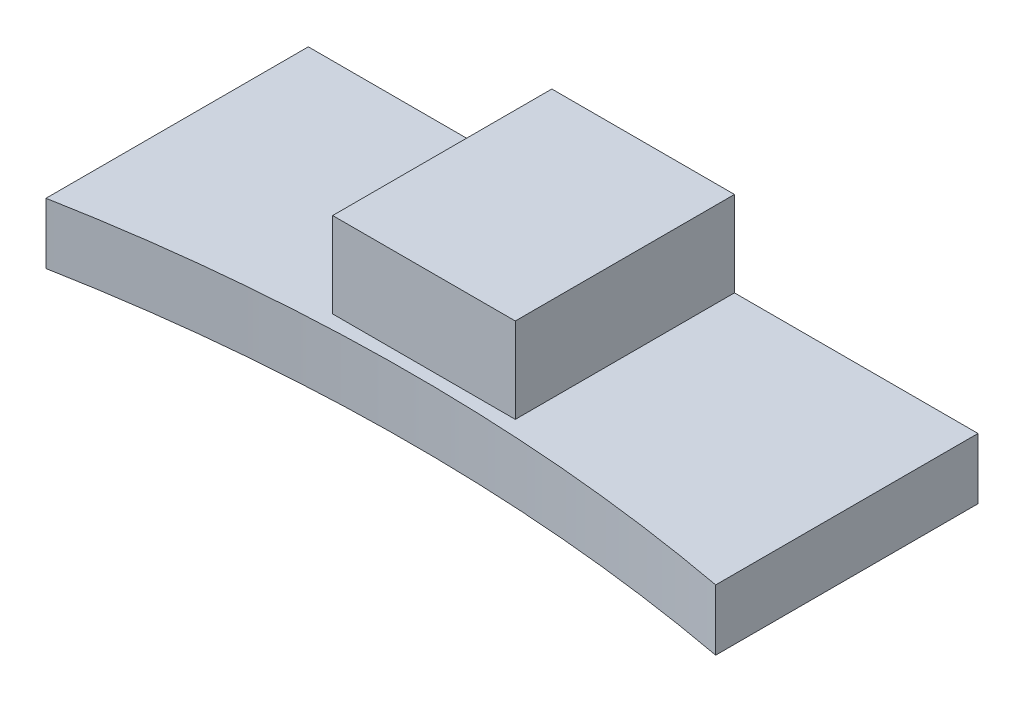
ISO-10303-21;
HEADER;
FILE_DESCRIPTION(('STEP AP214'),'2;1');
FILE_NAME('part.step','',(''),(''),'','','');
FILE_SCHEMA(('AUTOMOTIVE_DESIGN { 1 0 10303 214 1 1 1 1 }'));
ENDSEC;
DATA;
#1=APPLICATION_CONTEXT('core data for automotive mechanical design processes');
#2=APPLICATION_PROTOCOL_DEFINITION('international standard','automotive_design',2000,#1);
#3=PRODUCT_CONTEXT('',#1,'mechanical');
#4=PRODUCT('Part','Part','',(#3));
#5=PRODUCT_RELATED_PRODUCT_CATEGORY('part','',(#4));
#6=PRODUCT_DEFINITION_FORMATION('','',#4);
#7=PRODUCT_DEFINITION_CONTEXT('part definition',#1,'design');
#8=PRODUCT_DEFINITION('design','',#6,#7);
#9=PRODUCT_DEFINITION_SHAPE('','',#8);
#10=(LENGTH_UNIT() NAMED_UNIT(*) SI_UNIT(.MILLI.,.METRE.));
#11=(NAMED_UNIT(*) PLANE_ANGLE_UNIT() SI_UNIT($,.RADIAN.));
#12=(NAMED_UNIT(*) SI_UNIT($,.STERADIAN.) SOLID_ANGLE_UNIT());
#13=UNCERTAINTY_MEASURE_WITH_UNIT(LENGTH_MEASURE(1.E-05),#10,'distance_accuracy_value','');
#14=(GEOMETRIC_REPRESENTATION_CONTEXT(3) GLOBAL_UNCERTAINTY_ASSIGNED_CONTEXT((#13)) GLOBAL_UNIT_ASSIGNED_CONTEXT((#10,
#11,#12)) REPRESENTATION_CONTEXT('',''));
#15=CARTESIAN_POINT('',(0.,0.,0.));
#16=DIRECTION('',(0.,0.,1.));
#17=DIRECTION('',(1.,0.,0.));
#18=AXIS2_PLACEMENT_3D('',#15,#16,#17);
#19=CARTESIAN_POINT('',(27.5,5.,147.457621030586));
#20=DIRECTION('',(0.,-1.,0.));
#21=DIRECTION('',(0.,0.,-1.));
#22=AXIS2_PLACEMENT_3D('',#19,#20,#21);
#23=PLANE('',#22);
#24=DIRECTION('',(0.,0.,1.));
#25=VECTOR('',#24,1.);
#26=CARTESIAN_POINT('',(20.,5.,-21.5423789694138));
#27=LINE('',#26,#25);
#28=CARTESIAN_POINT('',(20.,5.,-21.5423789694138));
#29=VERTEX_POINT('',#28);
#30=CARTESIAN_POINT('',(20.,5.,-3.54237896941376));
#31=VERTEX_POINT('',#30);
#32=EDGE_CURVE('E55',#29,#31,#27,.T.);
#33=ORIENTED_EDGE('',*,*,#32,.F.);
#34=DIRECTION('',(-1.,0.,0.));
#35=VECTOR('',#34,1.);
#36=CARTESIAN_POINT('',(0.,5.,-21.5423789694138));
#37=LINE('',#36,#35);
#38=CARTESIAN_POINT('',(0.,5.,-21.5423789694138));
#39=VERTEX_POINT('',#38);
#40=EDGE_CURVE('E135',#29,#39,#37,.T.);
#41=ORIENTED_EDGE('',*,*,#40,.T.);
#42=DIRECTION('',(0.,0.,1.));
#43=VECTOR('',#42,1.);
#44=CARTESIAN_POINT('',(0.,5.,0.));
#45=LINE('',#44,#43);
#46=CARTESIAN_POINT('',(0.,5.,0.));
#47=VERTEX_POINT('',#46);
#48=EDGE_CURVE('E138',#39,#47,#45,.T.);
#49=ORIENTED_EDGE('',*,*,#48,.T.);
#50=CARTESIAN_POINT('',(27.5,5.,147.457621030586));
#51=DIRECTION('',(0.,-1.,0.));
#52=DIRECTION('',(0.,0.,-1.));
#53=AXIS2_PLACEMENT_3D('',#50,#51,#52);
#54=CIRCLE('',#53,150.);
#55=CARTESIAN_POINT('',(55.,5.,0.));
#56=VERTEX_POINT('',#55);
#57=EDGE_CURVE('E129',#47,#56,#54,.T.);
#58=ORIENTED_EDGE('',*,*,#57,.T.);
#59=DIRECTION('',(0.,0.,-1.));
#60=VECTOR('',#59,1.);
#61=CARTESIAN_POINT('',(55.,5.,-21.5423789694138));
#62=LINE('',#61,#60);
#63=CARTESIAN_POINT('',(55.,5.,-21.5423789694138));
#64=VERTEX_POINT('',#63);
#65=EDGE_CURVE('E132',#56,#64,#62,.T.);
#66=ORIENTED_EDGE('',*,*,#65,.T.);
#67=CARTESIAN_POINT('',(35.,5.,-21.5423789694138));
#68=VERTEX_POINT('',#67);
#69=EDGE_CURVE('E143',#64,#68,#37,.T.);
#70=ORIENTED_EDGE('',*,*,#69,.T.);
#71=DIRECTION('',(0.,0.,-1.));
#72=VECTOR('',#71,1.);
#73=CARTESIAN_POINT('',(35.,5.,-21.5423789694138));
#74=LINE('',#73,#72);
#75=CARTESIAN_POINT('',(35.,5.,-3.54237896941376));
#76=VERTEX_POINT('',#75);
#77=EDGE_CURVE('E117',#76,#68,#74,.T.);
#78=ORIENTED_EDGE('',*,*,#77,.F.);
#79=DIRECTION('',(1.,0.,0.));
#80=VECTOR('',#79,1.);
#81=CARTESIAN_POINT('',(20.,5.,-3.54237896941376));
#82=LINE('',#81,#80);
#83=EDGE_CURVE('E50',#31,#76,#82,.T.);
#84=ORIENTED_EDGE('',*,*,#83,.F.);
#85=EDGE_LOOP('',(#33,#41,#49,#58,#66,#70,#78,#84));
#86=FACE_BOUND('',#85,.T.);
#87=ADVANCED_FACE('F33',(#86),#23,.F.);
#88=CARTESIAN_POINT('',(27.5,5.,147.457621030586));
#89=DIRECTION('',(0.,-1.,0.));
#90=DIRECTION('',(0.,0.,-1.));
#91=AXIS2_PLACEMENT_3D('',#88,#89,#90);
#92=CYLINDRICAL_SURFACE('',#91,150.);
#93=CARTESIAN_POINT('',(27.5,0.,147.457621030586));
#94=DIRECTION('',(0.,-1.,0.));
#95=DIRECTION('',(0.,0.,-1.));
#96=AXIS2_PLACEMENT_3D('',#93,#94,#95);
#97=CIRCLE('',#96,150.);
#98=CARTESIAN_POINT('',(0.,0.,0.));
#99=VERTEX_POINT('',#98);
#100=CARTESIAN_POINT('',(55.,0.,0.));
#101=VERTEX_POINT('',#100);
#102=EDGE_CURVE('E120',#99,#101,#97,.T.);
#103=ORIENTED_EDGE('',*,*,#102,.T.);
#104=DIRECTION('',(0.,-1.,0.));
#105=VECTOR('',#104,1.);
#106=CARTESIAN_POINT('',(55.,5.,0.));
#107=LINE('',#106,#105);
#108=EDGE_CURVE('E11',#56,#101,#107,.T.);
#109=ORIENTED_EDGE('',*,*,#108,.F.);
#110=ORIENTED_EDGE('',*,*,#57,.F.);
#111=DIRECTION('',(0.,-1.,0.));
#112=VECTOR('',#111,1.);
#113=CARTESIAN_POINT('',(0.,5.,0.));
#114=LINE('',#113,#112);
#115=EDGE_CURVE('E150',#47,#99,#114,.T.);
#116=ORIENTED_EDGE('',*,*,#115,.T.);
#117=EDGE_LOOP('',(#103,#109,#110,#116));
#118=FACE_BOUND('',#117,.T.);
#119=ADVANCED_FACE('F35',(#118),#92,.F.);
#120=CARTESIAN_POINT('',(55.,5.,-21.5423789694138));
#121=DIRECTION('',(-1.,0.,0.));
#122=DIRECTION('',(0.,0.,1.));
#123=AXIS2_PLACEMENT_3D('',#120,#121,#122);
#124=PLANE('',#123);
#125=DIRECTION('',(0.,0.,-1.));
#126=VECTOR('',#125,1.);
#127=CARTESIAN_POINT('',(55.,0.,-21.5423789694138));
#128=LINE('',#127,#126);
#129=CARTESIAN_POINT('',(55.,0.,-21.5423789694138));
#130=VERTEX_POINT('',#129);
#131=EDGE_CURVE('E123',#101,#130,#128,.T.);
#132=ORIENTED_EDGE('',*,*,#131,.T.);
#133=DIRECTION('',(0.,-1.,0.));
#134=VECTOR('',#133,1.);
#135=CARTESIAN_POINT('',(55.,5.,-21.5423789694138));
#136=LINE('',#135,#134);
#137=EDGE_CURVE('E42',#64,#130,#136,.T.);
#138=ORIENTED_EDGE('',*,*,#137,.F.);
#139=ORIENTED_EDGE('',*,*,#65,.F.);
#140=ORIENTED_EDGE('',*,*,#108,.T.);
#141=EDGE_LOOP('',(#132,#138,#139,#140));
#142=FACE_BOUND('',#141,.T.);
#143=ADVANCED_FACE('F158',(#142),#124,.F.);
#144=CARTESIAN_POINT('',(0.,5.,-21.5423789694138));
#145=DIRECTION('',(0.,0.,1.));
#146=DIRECTION('',(1.,0.,0.));
#147=AXIS2_PLACEMENT_3D('',#144,#145,#146);
#148=PLANE('',#147);
#149=CARTESIAN_POINT('',(27.5,6.5,-21.5423789694138));
#150=DIRECTION('',(0.,0.,-1.));
#151=DIRECTION('',(-1.,0.,0.));
#152=AXIS2_PLACEMENT_3D('',#149,#150,#151);
#153=CIRCLE('',#152,4.5);
#154=CARTESIAN_POINT('',(23.,6.5,-21.5423789694138));
#155=VERTEX_POINT('',#154);
#156=EDGE_CURVE('E189',#155,#155,#153,.T.);
#157=ORIENTED_EDGE('',*,*,#156,.F.);
#158=EDGE_LOOP('',(#157));
#159=FACE_BOUND('',#158,.T.);
#160=DIRECTION('',(-1.,0.,0.));
#161=VECTOR('',#160,1.);
#162=CARTESIAN_POINT('',(0.,0.,-21.5423789694138));
#163=LINE('',#162,#161);
#164=CARTESIAN_POINT('',(0.,0.,-21.5423789694138));
#165=VERTEX_POINT('',#164);
#166=EDGE_CURVE('E154',#130,#165,#163,.T.);
#167=ORIENTED_EDGE('',*,*,#166,.T.);
#168=DIRECTION('',(0.,-1.,0.));
#169=VECTOR('',#168,1.);
#170=CARTESIAN_POINT('',(0.,5.,-21.5423789694138));
#171=LINE('',#170,#169);
#172=EDGE_CURVE('E147',#39,#165,#171,.T.);
#173=ORIENTED_EDGE('',*,*,#172,.F.);
#174=ORIENTED_EDGE('',*,*,#40,.F.);
#175=DIRECTION('',(0.,-1.,0.));
#176=VECTOR('',#175,1.);
#177=CARTESIAN_POINT('',(20.,12.,-21.5423789694138));
#178=LINE('',#177,#176);
#179=CARTESIAN_POINT('',(20.,12.,-21.5423789694138));
#180=VERTEX_POINT('',#179);
#181=EDGE_CURVE('E176',#180,#29,#178,.T.);
#182=ORIENTED_EDGE('',*,*,#181,.F.);
#183=DIRECTION('',(-1.,0.,0.));
#184=VECTOR('',#183,1.);
#185=CARTESIAN_POINT('',(20.,12.,-21.5423789694138));
#186=LINE('',#185,#184);
#187=CARTESIAN_POINT('',(35.,12.,-21.5423789694138));
#188=VERTEX_POINT('',#187);
#189=EDGE_CURVE('E113',#188,#180,#186,.T.);
#190=ORIENTED_EDGE('',*,*,#189,.F.);
#191=DIRECTION('',(0.,-1.,0.));
#192=VECTOR('',#191,1.);
#193=CARTESIAN_POINT('',(35.,12.,-21.5423789694138));
#194=LINE('',#193,#192);
#195=EDGE_CURVE('E125',#188,#68,#194,.T.);
#196=ORIENTED_EDGE('',*,*,#195,.T.);
#197=ORIENTED_EDGE('',*,*,#69,.F.);
#198=ORIENTED_EDGE('',*,*,#137,.T.);
#199=EDGE_LOOP('',(#167,#173,#174,#182,#190,#196,#197,#198));
#200=FACE_BOUND('',#199,.T.);
#201=ADVANCED_FACE('F165',(#159,#200),#148,.F.);
#202=CARTESIAN_POINT('',(0.,5.,0.));
#203=DIRECTION('',(1.,0.,0.));
#204=DIRECTION('',(0.,0.,-1.));
#205=AXIS2_PLACEMENT_3D('',#202,#203,#204);
#206=PLANE('',#205);
#207=DIRECTION('',(0.,0.,1.));
#208=VECTOR('',#207,1.);
#209=CARTESIAN_POINT('',(0.,0.,0.));
#210=LINE('',#209,#208);
#211=EDGE_CURVE('E133',#165,#99,#210,.T.);
#212=ORIENTED_EDGE('',*,*,#211,.T.);
#213=ORIENTED_EDGE('',*,*,#115,.F.);
#214=ORIENTED_EDGE('',*,*,#48,.F.);
#215=ORIENTED_EDGE('',*,*,#172,.T.);
#216=EDGE_LOOP('',(#212,#213,#214,#215));
#217=FACE_BOUND('',#216,.T.);
#218=ADVANCED_FACE('F172',(#217),#206,.F.);
#219=CARTESIAN_POINT('',(27.5,0.,147.457621030586));
#220=DIRECTION('',(0.,-1.,0.));
#221=DIRECTION('',(0.,0.,-1.));
#222=AXIS2_PLACEMENT_3D('',#219,#220,#221);
#223=PLANE('',#222);
#224=ORIENTED_EDGE('',*,*,#102,.F.);
#225=ORIENTED_EDGE('',*,*,#211,.F.);
#226=ORIENTED_EDGE('',*,*,#166,.F.);
#227=ORIENTED_EDGE('',*,*,#131,.F.);
#228=EDGE_LOOP('',(#224,#225,#226,#227));
#229=FACE_BOUND('',#228,.T.);
#230=ADVANCED_FACE('F169',(#229),#223,.T.);
#231=CARTESIAN_POINT('',(20.,12.,-21.5423789694138));
#232=DIRECTION('',(1.,0.,0.));
#233=DIRECTION('',(0.,0.,-1.));
#234=AXIS2_PLACEMENT_3D('',#231,#232,#233);
#235=PLANE('',#234);
#236=ORIENTED_EDGE('',*,*,#32,.T.);
#237=DIRECTION('',(0.,-1.,0.));
#238=VECTOR('',#237,1.);
#239=CARTESIAN_POINT('',(20.,12.,-3.54237896941376));
#240=LINE('',#239,#238);
#241=CARTESIAN_POINT('',(20.,12.,-3.54237896941376));
#242=VERTEX_POINT('',#241);
#243=EDGE_CURVE('E102',#242,#31,#240,.T.);
#244=ORIENTED_EDGE('',*,*,#243,.F.);
#245=DIRECTION('',(0.,0.,1.));
#246=VECTOR('',#245,1.);
#247=CARTESIAN_POINT('',(20.,12.,-21.5423789694138));
#248=LINE('',#247,#246);
#249=EDGE_CURVE('E108',#180,#242,#248,.T.);
#250=ORIENTED_EDGE('',*,*,#249,.F.);
#251=ORIENTED_EDGE('',*,*,#181,.T.);
#252=EDGE_LOOP('',(#236,#244,#250,#251));
#253=FACE_BOUND('',#252,.T.);
#254=ADVANCED_FACE('F119',(#253),#235,.F.);
#255=CARTESIAN_POINT('',(20.,12.,-3.54237896941376));
#256=DIRECTION('',(0.,0.,-1.));
#257=DIRECTION('',(-1.,0.,0.));
#258=AXIS2_PLACEMENT_3D('',#255,#256,#257);
#259=PLANE('',#258);
#260=ORIENTED_EDGE('',*,*,#83,.T.);
#261=DIRECTION('',(0.,-1.,0.));
#262=VECTOR('',#261,1.);
#263=CARTESIAN_POINT('',(35.,12.,-3.54237896941376));
#264=LINE('',#263,#262);
#265=CARTESIAN_POINT('',(35.,12.,-3.54237896941376));
#266=VERTEX_POINT('',#265);
#267=EDGE_CURVE('E104',#266,#76,#264,.T.);
#268=ORIENTED_EDGE('',*,*,#267,.F.);
#269=DIRECTION('',(1.,0.,0.));
#270=VECTOR('',#269,1.);
#271=CARTESIAN_POINT('',(20.,12.,-3.54237896941376));
#272=LINE('',#271,#270);
#273=EDGE_CURVE('E98',#242,#266,#272,.T.);
#274=ORIENTED_EDGE('',*,*,#273,.F.);
#275=ORIENTED_EDGE('',*,*,#243,.T.);
#276=EDGE_LOOP('',(#260,#268,#274,#275));
#277=FACE_BOUND('',#276,.T.);
#278=ADVANCED_FACE('F100',(#277),#259,.F.);
#279=CARTESIAN_POINT('',(35.,12.,-21.5423789694138));
#280=DIRECTION('',(-1.,0.,0.));
#281=DIRECTION('',(0.,0.,1.));
#282=AXIS2_PLACEMENT_3D('',#279,#280,#281);
#283=PLANE('',#282);
#284=ORIENTED_EDGE('',*,*,#77,.T.);
#285=ORIENTED_EDGE('',*,*,#195,.F.);
#286=DIRECTION('',(0.,0.,-1.));
#287=VECTOR('',#286,1.);
#288=CARTESIAN_POINT('',(35.,12.,-21.5423789694138));
#289=LINE('',#288,#287);
#290=EDGE_CURVE('E107',#266,#188,#289,.T.);
#291=ORIENTED_EDGE('',*,*,#290,.F.);
#292=ORIENTED_EDGE('',*,*,#267,.T.);
#293=EDGE_LOOP('',(#284,#285,#291,#292));
#294=FACE_BOUND('',#293,.T.);
#295=ADVANCED_FACE('F239',(#294),#283,.F.);
#296=CARTESIAN_POINT('',(0.,12.,0.));
#297=DIRECTION('',(0.,1.,0.));
#298=DIRECTION('',(0.,0.,1.));
#299=AXIS2_PLACEMENT_3D('',#296,#297,#298);
#300=PLANE('',#299);
#301=ORIENTED_EDGE('',*,*,#249,.T.);
#302=ORIENTED_EDGE('',*,*,#273,.T.);
#303=ORIENTED_EDGE('',*,*,#290,.T.);
#304=ORIENTED_EDGE('',*,*,#189,.T.);
#305=EDGE_LOOP('',(#301,#302,#303,#304));
#306=FACE_BOUND('',#305,.T.);
#307=ADVANCED_FACE('F111',(#306),#300,.T.);
#308=CARTESIAN_POINT('',(27.5,6.5,-17.5423789694138));
#309=DIRECTION('',(0.,0.,-1.));
#310=DIRECTION('',(-1.,0.,0.));
#311=AXIS2_PLACEMENT_3D('',#308,#309,#310);
#312=CYLINDRICAL_SURFACE('',#311,4.5);
#313=CARTESIAN_POINT('',(27.5,6.5,-17.5423789694138));
#314=DIRECTION('',(0.,0.,-1.));
#315=DIRECTION('',(-1.,0.,0.));
#316=AXIS2_PLACEMENT_3D('',#313,#314,#315);
#317=CIRCLE('',#316,4.5);
#318=CARTESIAN_POINT('',(23.,6.5,-17.5423789694138));
#319=VERTEX_POINT('',#318);
#320=EDGE_CURVE('E192',#319,#319,#317,.T.);
#321=ORIENTED_EDGE('',*,*,#320,.F.);
#322=EDGE_LOOP('',(#321));
#323=FACE_BOUND('',#322,.T.);
#324=ORIENTED_EDGE('',*,*,#156,.T.);
#325=EDGE_LOOP('',(#324));
#326=FACE_BOUND('',#325,.T.);
#327=ADVANCED_FACE('F208',(#323,#326),#312,.F.);
#328=CARTESIAN_POINT('',(27.5,6.5,-17.5423789694138));
#329=DIRECTION('',(0.,0.,-1.));
#330=DIRECTION('',(-1.,0.,0.));
#331=AXIS2_PLACEMENT_3D('',#328,#329,#330);
#332=PLANE('',#331);
#333=CARTESIAN_POINT('',(27.5,6.5,-17.5423789694138));
#334=DIRECTION('',(0.,0.,-1.));
#335=DIRECTION('',(-1.,0.,0.));
#336=AXIS2_PLACEMENT_3D('',#333,#334,#335);
#337=CIRCLE('',#336,3.4);
#338=CARTESIAN_POINT('',(24.1,6.5,-17.5423789694138));
#339=VERTEX_POINT('',#338);
#340=EDGE_CURVE('E198',#339,#339,#337,.T.);
#341=ORIENTED_EDGE('',*,*,#340,.F.);
#342=EDGE_LOOP('',(#341));
#343=FACE_BOUND('',#342,.T.);
#344=ORIENTED_EDGE('',*,*,#320,.T.);
#345=EDGE_LOOP('',(#344));
#346=FACE_BOUND('',#345,.T.);
#347=ADVANCED_FACE('F204',(#343,#346),#332,.T.);
#348=CARTESIAN_POINT('',(27.5,6.5,-9.54237896941376));
#349=DIRECTION('',(0.,0.,1.));
#350=DIRECTION('',(1.,0.,0.));
#351=AXIS2_PLACEMENT_3D('',#348,#349,#350);
#352=PLANE('',#351);
#353=CARTESIAN_POINT('',(27.5,6.5,-9.54237896941376));
#354=DIRECTION('',(0.,0.,-1.));
#355=DIRECTION('',(-1.,0.,0.));
#356=AXIS2_PLACEMENT_3D('',#353,#354,#355);
#357=CIRCLE('',#356,3.4);
#358=CARTESIAN_POINT('',(24.1,6.5,-9.54237896941376));
#359=VERTEX_POINT('',#358);
#360=EDGE_CURVE('E193',#359,#359,#357,.T.);
#361=ORIENTED_EDGE('',*,*,#360,.T.);
#362=EDGE_LOOP('',(#361));
#363=FACE_BOUND('',#362,.T.);
#364=ADVANCED_FACE('F207',(#363),#352,.F.);
#365=CARTESIAN_POINT('',(27.5,6.5,-17.5423789694138));
#366=DIRECTION('',(0.,0.,-1.));
#367=DIRECTION('',(-1.,0.,0.));
#368=AXIS2_PLACEMENT_3D('',#365,#366,#367);
#369=CYLINDRICAL_SURFACE('',#368,3.4);
#370=ORIENTED_EDGE('',*,*,#360,.F.);
#371=EDGE_LOOP('',(#370));
#372=FACE_BOUND('',#371,.T.);
#373=ORIENTED_EDGE('',*,*,#340,.T.);
#374=EDGE_LOOP('',(#373));
#375=FACE_BOUND('',#374,.T.);
#376=ADVANCED_FACE('F202',(#372,#375),#369,.F.);
#377=CLOSED_SHELL('',(#87,#119,#143,#201,#218,#230,#254,#278,#295,#307,#327,#347,#364,#376));
#378=MANIFOLD_SOLID_BREP('B2',#377);
#379=ADVANCED_BREP_SHAPE_REPRESENTATION('',(#18,#378),#14);
#380=SHAPE_DEFINITION_REPRESENTATION(#9,#379);
ENDSEC;
END-ISO-10303-21;
